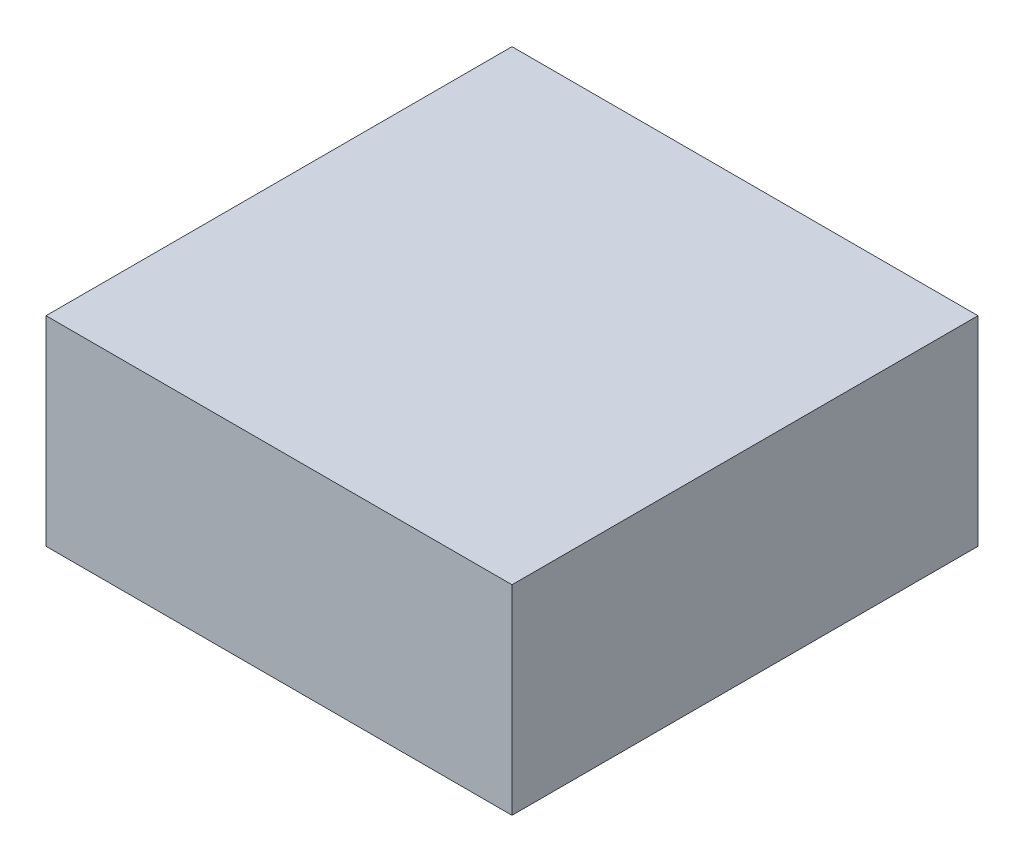
ISO-10303-21;
HEADER;
FILE_DESCRIPTION(('STEP AP214'),'2;1');
FILE_NAME('part.step','',(''),(''),'','','');
FILE_SCHEMA(('AUTOMOTIVE_DESIGN { 1 0 10303 214 1 1 1 1 }'));
ENDSEC;
DATA;
#1=APPLICATION_CONTEXT('core data for automotive mechanical design processes');
#2=APPLICATION_PROTOCOL_DEFINITION('international standard','automotive_design',2000,#1);
#3=PRODUCT_CONTEXT('',#1,'mechanical');
#4=PRODUCT('Part','Part','',(#3));
#5=PRODUCT_RELATED_PRODUCT_CATEGORY('part','',(#4));
#6=PRODUCT_DEFINITION_FORMATION('','',#4);
#7=PRODUCT_DEFINITION_CONTEXT('part definition',#1,'design');
#8=PRODUCT_DEFINITION('design','',#6,#7);
#9=PRODUCT_DEFINITION_SHAPE('','',#8);
#10=(LENGTH_UNIT() NAMED_UNIT(*) SI_UNIT(.MILLI.,.METRE.));
#11=(NAMED_UNIT(*) PLANE_ANGLE_UNIT() SI_UNIT($,.RADIAN.));
#12=(NAMED_UNIT(*) SI_UNIT($,.STERADIAN.) SOLID_ANGLE_UNIT());
#13=UNCERTAINTY_MEASURE_WITH_UNIT(LENGTH_MEASURE(1.E-05),#10,'distance_accuracy_value','');
#14=(GEOMETRIC_REPRESENTATION_CONTEXT(3) GLOBAL_UNCERTAINTY_ASSIGNED_CONTEXT((#13)) GLOBAL_UNIT_ASSIGNED_CONTEXT((#10,
#11,#12)) REPRESENTATION_CONTEXT('',''));
#15=CARTESIAN_POINT('',(0.,0.,0.));
#16=DIRECTION('',(0.,0.,1.));
#17=DIRECTION('',(1.,0.,0.));
#18=AXIS2_PLACEMENT_3D('',#15,#16,#17);
#19=CARTESIAN_POINT('',(0.,38.1,0.));
#20=DIRECTION('',(1.,0.,0.));
#21=DIRECTION('',(0.,0.,-1.));
#22=AXIS2_PLACEMENT_3D('',#19,#20,#21);
#23=PLANE('',#22);
#24=DIRECTION('',(0.,0.,1.));
#25=VECTOR('',#24,1.);
#26=CARTESIAN_POINT('',(0.,0.,0.));
#27=LINE('',#26,#25);
#28=CARTESIAN_POINT('',(0.,0.,0.));
#29=VERTEX_POINT('',#28);
#30=CARTESIAN_POINT('',(0.,0.,88.9));
#31=VERTEX_POINT('',#30);
#32=EDGE_CURVE('E95',#29,#31,#27,.T.);
#33=ORIENTED_EDGE('',*,*,#32,.T.);
#34=DIRECTION('',(0.,-1.,0.));
#35=VECTOR('',#34,1.);
#36=CARTESIAN_POINT('',(0.,38.1,88.9));
#37=LINE('',#36,#35);
#38=CARTESIAN_POINT('',(0.,38.1,88.9));
#39=VERTEX_POINT('',#38);
#40=EDGE_CURVE('E11',#39,#31,#37,.T.);
#41=ORIENTED_EDGE('',*,*,#40,.F.);
#42=DIRECTION('',(0.,0.,1.));
#43=VECTOR('',#42,1.);
#44=CARTESIAN_POINT('',(0.,38.1,0.));
#45=LINE('',#44,#43);
#46=CARTESIAN_POINT('',(0.,38.1,0.));
#47=VERTEX_POINT('',#46);
#48=EDGE_CURVE('E83',#47,#39,#45,.T.);
#49=ORIENTED_EDGE('',*,*,#48,.F.);
#50=DIRECTION('',(0.,-1.,0.));
#51=VECTOR('',#50,1.);
#52=CARTESIAN_POINT('',(0.,38.1,0.));
#53=LINE('',#52,#51);
#54=EDGE_CURVE('E91',#47,#29,#53,.T.);
#55=ORIENTED_EDGE('',*,*,#54,.T.);
#56=EDGE_LOOP('',(#33,#41,#49,#55));
#57=FACE_BOUND('',#56,.T.);
#58=ADVANCED_FACE('F32',(#57),#23,.F.);
#59=CARTESIAN_POINT('',(0.,38.1,88.9));
#60=DIRECTION('',(0.,0.,-1.));
#61=DIRECTION('',(-1.,0.,0.));
#62=AXIS2_PLACEMENT_3D('',#59,#60,#61);
#63=PLANE('',#62);
#64=DIRECTION('',(1.,0.,0.));
#65=VECTOR('',#64,1.);
#66=CARTESIAN_POINT('',(0.,0.,88.9));
#67=LINE('',#66,#65);
#68=CARTESIAN_POINT('',(88.9,0.,88.9));
#69=VERTEX_POINT('',#68);
#70=EDGE_CURVE('E87',#31,#69,#67,.T.);
#71=ORIENTED_EDGE('',*,*,#70,.T.);
#72=DIRECTION('',(0.,-1.,0.));
#73=VECTOR('',#72,1.);
#74=CARTESIAN_POINT('',(88.9,38.1,88.9));
#75=LINE('',#74,#73);
#76=CARTESIAN_POINT('',(88.9,38.1,88.9));
#77=VERTEX_POINT('',#76);
#78=EDGE_CURVE('E40',#77,#69,#75,.T.);
#79=ORIENTED_EDGE('',*,*,#78,.F.);
#80=DIRECTION('',(1.,0.,0.));
#81=VECTOR('',#80,1.);
#82=CARTESIAN_POINT('',(0.,38.1,88.9));
#83=LINE('',#82,#81);
#84=EDGE_CURVE('E78',#39,#77,#83,.T.);
#85=ORIENTED_EDGE('',*,*,#84,.F.);
#86=ORIENTED_EDGE('',*,*,#40,.T.);
#87=EDGE_LOOP('',(#71,#79,#85,#86));
#88=FACE_BOUND('',#87,.T.);
#89=ADVANCED_FACE('F86',(#88),#63,.F.);
#90=CARTESIAN_POINT('',(88.9,38.1,0.));
#91=DIRECTION('',(-1.,0.,0.));
#92=DIRECTION('',(0.,0.,1.));
#93=AXIS2_PLACEMENT_3D('',#90,#91,#92);
#94=PLANE('',#93);
#95=DIRECTION('',(0.,0.,-1.));
#96=VECTOR('',#95,1.);
#97=CARTESIAN_POINT('',(88.9,0.,0.));
#98=LINE('',#97,#96);
#99=CARTESIAN_POINT('',(88.9,0.,0.));
#100=VERTEX_POINT('',#99);
#101=EDGE_CURVE('E65',#69,#100,#98,.T.);
#102=ORIENTED_EDGE('',*,*,#101,.T.);
#103=DIRECTION('',(0.,-1.,0.));
#104=VECTOR('',#103,1.);
#105=CARTESIAN_POINT('',(88.9,38.1,0.));
#106=LINE('',#105,#104);
#107=CARTESIAN_POINT('',(88.9,38.1,0.));
#108=VERTEX_POINT('',#107);
#109=EDGE_CURVE('E88',#108,#100,#106,.T.);
#110=ORIENTED_EDGE('',*,*,#109,.F.);
#111=DIRECTION('',(0.,0.,-1.));
#112=VECTOR('',#111,1.);
#113=CARTESIAN_POINT('',(88.9,38.1,0.));
#114=LINE('',#113,#112);
#115=EDGE_CURVE('E81',#77,#108,#114,.T.);
#116=ORIENTED_EDGE('',*,*,#115,.F.);
#117=ORIENTED_EDGE('',*,*,#78,.T.);
#118=EDGE_LOOP('',(#102,#110,#116,#117));
#119=FACE_BOUND('',#118,.T.);
#120=ADVANCED_FACE('F89',(#119),#94,.F.);
#121=CARTESIAN_POINT('',(0.,38.1,0.));
#122=DIRECTION('',(0.,0.,1.));
#123=DIRECTION('',(1.,0.,0.));
#124=AXIS2_PLACEMENT_3D('',#121,#122,#123);
#125=PLANE('',#124);
#126=DIRECTION('',(-1.,0.,0.));
#127=VECTOR('',#126,1.);
#128=CARTESIAN_POINT('',(0.,0.,0.));
#129=LINE('',#128,#127);
#130=EDGE_CURVE('E71',#100,#29,#129,.T.);
#131=ORIENTED_EDGE('',*,*,#130,.T.);
#132=ORIENTED_EDGE('',*,*,#54,.F.);
#133=DIRECTION('',(-1.,0.,0.));
#134=VECTOR('',#133,1.);
#135=CARTESIAN_POINT('',(0.,38.1,0.));
#136=LINE('',#135,#134);
#137=EDGE_CURVE('E48',#108,#47,#136,.T.);
#138=ORIENTED_EDGE('',*,*,#137,.F.);
#139=ORIENTED_EDGE('',*,*,#109,.T.);
#140=EDGE_LOOP('',(#131,#132,#138,#139));
#141=FACE_BOUND('',#140,.T.);
#142=ADVANCED_FACE('F102',(#141),#125,.F.);
#143=CARTESIAN_POINT('',(0.,38.1,0.));
#144=DIRECTION('',(0.,1.,0.));
#145=DIRECTION('',(0.,0.,1.));
#146=AXIS2_PLACEMENT_3D('',#143,#144,#145);
#147=PLANE('',#146);
#148=ORIENTED_EDGE('',*,*,#48,.T.);
#149=ORIENTED_EDGE('',*,*,#84,.T.);
#150=ORIENTED_EDGE('',*,*,#115,.T.);
#151=ORIENTED_EDGE('',*,*,#137,.T.);
#152=EDGE_LOOP('',(#148,#149,#150,#151));
#153=FACE_BOUND('',#152,.T.);
#154=ADVANCED_FACE('F79',(#153),#147,.T.);
#155=CARTESIAN_POINT('',(0.,0.,0.));
#156=DIRECTION('',(0.,1.,0.));
#157=DIRECTION('',(0.,0.,1.));
#158=AXIS2_PLACEMENT_3D('',#155,#156,#157);
#159=PLANE('',#158);
#160=ORIENTED_EDGE('',*,*,#32,.F.);
#161=ORIENTED_EDGE('',*,*,#130,.F.);
#162=ORIENTED_EDGE('',*,*,#101,.F.);
#163=ORIENTED_EDGE('',*,*,#70,.F.);
#164=EDGE_LOOP('',(#160,#161,#162,#163));
#165=FACE_BOUND('',#164,.T.);
#166=ADVANCED_FACE('F105',(#165),#159,.F.);
#167=CLOSED_SHELL('',(#58,#89,#120,#142,#154,#166));
#168=MANIFOLD_SOLID_BREP('B2',#167);
#169=ADVANCED_BREP_SHAPE_REPRESENTATION('',(#18,#168),#14);
#170=SHAPE_DEFINITION_REPRESENTATION(#9,#169);
ENDSEC;
END-ISO-10303-21;
